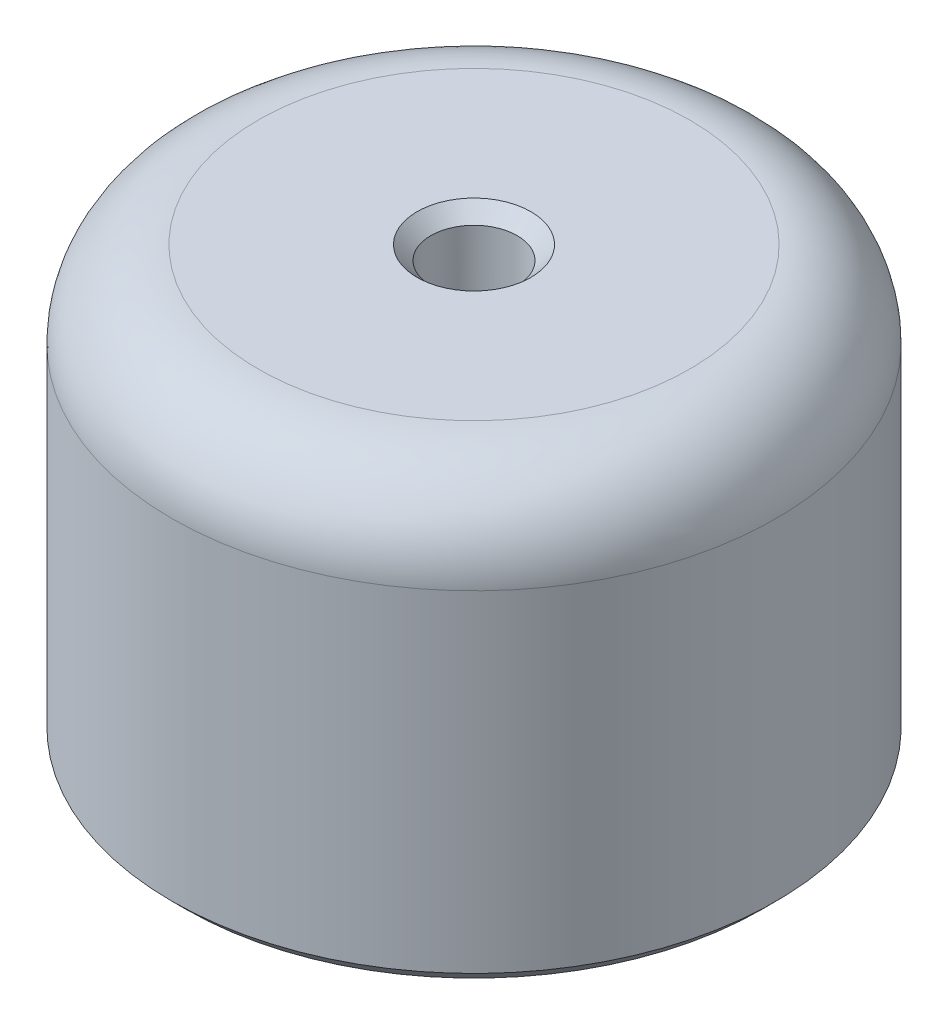
ISO-10303-21;
HEADER;
FILE_DESCRIPTION(('STEP AP214'),'2;1');
FILE_NAME('part.step','',(''),(''),'','','');
FILE_SCHEMA(('AUTOMOTIVE_DESIGN { 1 0 10303 214 1 1 1 1 }'));
ENDSEC;
DATA;
#1=APPLICATION_CONTEXT('core data for automotive mechanical design processes');
#2=APPLICATION_PROTOCOL_DEFINITION('international standard','automotive_design',2000,#1);
#3=PRODUCT_CONTEXT('',#1,'mechanical');
#4=PRODUCT('Part','Part','',(#3));
#5=PRODUCT_RELATED_PRODUCT_CATEGORY('part','',(#4));
#6=PRODUCT_DEFINITION_FORMATION('','',#4);
#7=PRODUCT_DEFINITION_CONTEXT('part definition',#1,'design');
#8=PRODUCT_DEFINITION('design','',#6,#7);
#9=PRODUCT_DEFINITION_SHAPE('','',#8);
#10=(LENGTH_UNIT() NAMED_UNIT(*) SI_UNIT(.MILLI.,.METRE.));
#11=(NAMED_UNIT(*) PLANE_ANGLE_UNIT() SI_UNIT($,.RADIAN.));
#12=(NAMED_UNIT(*) SI_UNIT($,.STERADIAN.) SOLID_ANGLE_UNIT());
#13=UNCERTAINTY_MEASURE_WITH_UNIT(LENGTH_MEASURE(1.E-05),#10,'distance_accuracy_value','');
#14=(GEOMETRIC_REPRESENTATION_CONTEXT(3) GLOBAL_UNCERTAINTY_ASSIGNED_CONTEXT((#13)) GLOBAL_UNIT_ASSIGNED_CONTEXT((#10,
#11,#12)) REPRESENTATION_CONTEXT('',''));
#15=CARTESIAN_POINT('',(0.,0.,0.));
#16=DIRECTION('',(0.,0.,1.));
#17=DIRECTION('',(1.,0.,0.));
#18=AXIS2_PLACEMENT_3D('',#15,#16,#17);
#19=CARTESIAN_POINT('',(11.1125,15.875,0.));
#20=DIRECTION('',(0.,-1.,0.));
#21=DIRECTION('',(0.,0.,-1.));
#22=AXIS2_PLACEMENT_3D('',#19,#20,#21);
#23=PLANE('',#22);
#24=CARTESIAN_POINT('',(0.,15.875,0.));
#25=DIRECTION('',(0.,-1.,0.));
#26=DIRECTION('',(0.,0.,-1.));
#27=AXIS2_PLACEMENT_3D('',#24,#25,#26);
#28=CIRCLE('',#27,2.09550000000001);
#29=CARTESIAN_POINT('',(0.,15.875,-2.09550000000001));
#30=VERTEX_POINT('',#29);
#31=EDGE_CURVE('E59',#30,#30,#28,.T.);
#32=ORIENTED_EDGE('',*,*,#31,.T.);
#33=EDGE_LOOP('',(#32));
#34=FACE_BOUND('',#33,.T.);
#35=CARTESIAN_POINT('',(0.,15.875,0.));
#36=DIRECTION('',(0.,-1.,0.));
#37=DIRECTION('',(0.,0.,-1.));
#38=AXIS2_PLACEMENT_3D('',#35,#36,#37);
#39=CIRCLE('',#38,7.9375);
#40=CARTESIAN_POINT('',(0.,15.875,-7.9375));
#41=VERTEX_POINT('',#40);
#42=EDGE_CURVE('E71',#41,#41,#39,.F.);
#43=ORIENTED_EDGE('',*,*,#42,.T.);
#44=EDGE_LOOP('',(#43));
#45=FACE_BOUND('',#44,.T.);
#46=ADVANCED_FACE('F30',(#34,#45),#23,.F.);
#47=CARTESIAN_POINT('',(0.,3.13706341911764,0.));
#48=DIRECTION('',(0.,1.,0.));
#49=DIRECTION('',(0.,0.,1.));
#50=AXIS2_PLACEMENT_3D('',#47,#48,#49);
#51=CYLINDRICAL_SURFACE('',#50,1.5875);
#52=CARTESIAN_POINT('',(0.,15.367,0.));
#53=DIRECTION('',(0.,-1.,0.));
#54=DIRECTION('',(0.,0.,-1.));
#55=AXIS2_PLACEMENT_3D('',#52,#53,#54);
#56=CIRCLE('',#55,1.5875);
#57=CARTESIAN_POINT('',(0.,15.367,-1.5875));
#58=VERTEX_POINT('',#57);
#59=EDGE_CURVE('E62',#58,#58,#56,.F.);
#60=ORIENTED_EDGE('',*,*,#59,.T.);
#61=EDGE_LOOP('',(#60));
#62=FACE_BOUND('',#61,.T.);
#63=CARTESIAN_POINT('',(0.,13.208,0.));
#64=DIRECTION('',(0.,1.,0.));
#65=DIRECTION('',(0.,0.,1.));
#66=AXIS2_PLACEMENT_3D('',#63,#64,#65);
#67=CIRCLE('',#66,1.5875);
#68=CARTESIAN_POINT('',(0.,13.208,1.5875));
#69=VERTEX_POINT('',#68);
#70=EDGE_CURVE('E65',#69,#69,#67,.F.);
#71=ORIENTED_EDGE('',*,*,#70,.T.);
#72=EDGE_LOOP('',(#71));
#73=FACE_BOUND('',#72,.T.);
#74=ADVANCED_FACE('F103',(#62,#73),#51,.F.);
#75=CARTESIAN_POINT('',(1.5875,12.7,0.));
#76=DIRECTION('',(0.,1.,0.));
#77=DIRECTION('',(0.,0.,1.));
#78=AXIS2_PLACEMENT_3D('',#75,#76,#77);
#79=PLANE('',#78);
#80=CARTESIAN_POINT('',(0.,12.7,0.));
#81=DIRECTION('',(0.,1.,0.));
#82=DIRECTION('',(0.,0.,1.));
#83=AXIS2_PLACEMENT_3D('',#80,#81,#82);
#84=CIRCLE('',#83,2.09549999999999);
#85=CARTESIAN_POINT('',(0.,12.7,2.09549999999999));
#86=VERTEX_POINT('',#85);
#87=EDGE_CURVE('E56',#86,#86,#84,.T.);
#88=ORIENTED_EDGE('',*,*,#87,.T.);
#89=EDGE_LOOP('',(#88));
#90=FACE_BOUND('',#89,.T.);
#91=CARTESIAN_POINT('',(0.,12.7,0.));
#92=DIRECTION('',(0.,1.,0.));
#93=DIRECTION('',(0.,0.,1.));
#94=AXIS2_PLACEMENT_3D('',#91,#92,#93);
#95=CIRCLE('',#94,4.7625);
#96=CARTESIAN_POINT('',(0.,12.7,4.7625));
#97=VERTEX_POINT('',#96);
#98=EDGE_CURVE('E74',#97,#97,#95,.F.);
#99=ORIENTED_EDGE('',*,*,#98,.T.);
#100=EDGE_LOOP('',(#99));
#101=FACE_BOUND('',#100,.T.);
#102=ADVANCED_FACE('F108',(#90,#101),#79,.F.);
#103=CARTESIAN_POINT('',(0.,3.13706341911764,0.));
#104=DIRECTION('',(0.,1.,0.));
#105=DIRECTION('',(0.,0.,1.));
#106=AXIS2_PLACEMENT_3D('',#103,#104,#105);
#107=CYLINDRICAL_SURFACE('',#106,6.35);
#108=CARTESIAN_POINT('',(0.,8.44550000000002,0.));
#109=DIRECTION('',(0.,1.,0.));
#110=DIRECTION('',(0.,0.,1.));
#111=AXIS2_PLACEMENT_3D('',#108,#109,#110);
#112=CIRCLE('',#111,6.35);
#113=CARTESIAN_POINT('',(0.,8.44550000000002,-6.35));
#114=VERTEX_POINT('',#113);
#115=EDGE_CURVE('E10',#114,#114,#112,.F.);
#116=ORIENTED_EDGE('',*,*,#115,.T.);
#117=EDGE_LOOP('',(#116));
#118=FACE_BOUND('',#117,.T.);
#119=CARTESIAN_POINT('',(0.,11.1125,0.));
#120=DIRECTION('',(0.,1.,0.));
#121=DIRECTION('',(0.,0.,1.));
#122=AXIS2_PLACEMENT_3D('',#119,#120,#121);
#123=CIRCLE('',#122,6.35);
#124=CARTESIAN_POINT('',(0.,11.1125,6.35));
#125=VERTEX_POINT('',#124);
#126=EDGE_CURVE('E77',#125,#125,#123,.T.);
#127=ORIENTED_EDGE('',*,*,#126,.T.);
#128=EDGE_LOOP('',(#127));
#129=FACE_BOUND('',#128,.T.);
#130=ADVANCED_FACE('F115',(#118,#129),#107,.F.);
#131=CARTESIAN_POINT('',(0.,3.13706341911764,0.));
#132=DIRECTION('',(0.,1.,0.));
#133=DIRECTION('',(0.,0.,1.));
#134=AXIS2_PLACEMENT_3D('',#131,#132,#133);
#135=CYLINDRICAL_SURFACE('',#134,7.9375);
#136=CARTESIAN_POINT('',(0.,0.508,0.));
#137=DIRECTION('',(0.,1.,0.));
#138=DIRECTION('',(0.,0.,1.));
#139=AXIS2_PLACEMENT_3D('',#136,#137,#138);
#140=CIRCLE('',#139,7.9375);
#141=CARTESIAN_POINT('',(0.,0.508,7.9375));
#142=VERTEX_POINT('',#141);
#143=EDGE_CURVE('E45',#142,#142,#140,.F.);
#144=ORIENTED_EDGE('',*,*,#143,.T.);
#145=EDGE_LOOP('',(#144));
#146=FACE_BOUND('',#145,.T.);
#147=CARTESIAN_POINT('',(0.,6.35,0.));
#148=DIRECTION('',(0.,1.,0.));
#149=DIRECTION('',(0.,0.,1.));
#150=AXIS2_PLACEMENT_3D('',#147,#148,#149);
#151=CIRCLE('',#150,7.9375);
#152=CARTESIAN_POINT('',(0.,6.35,7.9375));
#153=VERTEX_POINT('',#152);
#154=EDGE_CURVE('E80',#153,#153,#151,.T.);
#155=ORIENTED_EDGE('',*,*,#154,.T.);
#156=EDGE_LOOP('',(#155));
#157=FACE_BOUND('',#156,.T.);
#158=ADVANCED_FACE('F84',(#146,#157),#135,.F.);
#159=CARTESIAN_POINT('',(7.9375,0.,0.));
#160=DIRECTION('',(0.,1.,0.));
#161=DIRECTION('',(0.,0.,1.));
#162=AXIS2_PLACEMENT_3D('',#159,#160,#161);
#163=PLANE('',#162);
#164=CARTESIAN_POINT('',(0.,0.,0.));
#165=DIRECTION('',(0.,1.,0.));
#166=DIRECTION('',(0.,0.,1.));
#167=AXIS2_PLACEMENT_3D('',#164,#165,#166);
#168=CIRCLE('',#167,8.4455);
#169=CARTESIAN_POINT('',(0.,0.,8.4455));
#170=VERTEX_POINT('',#169);
#171=EDGE_CURVE('E50',#170,#170,#168,.T.);
#172=ORIENTED_EDGE('',*,*,#171,.T.);
#173=EDGE_LOOP('',(#172));
#174=FACE_BOUND('',#173,.T.);
#175=CARTESIAN_POINT('',(0.,0.,0.));
#176=DIRECTION('',(0.,1.,0.));
#177=DIRECTION('',(0.,0.,1.));
#178=AXIS2_PLACEMENT_3D('',#175,#176,#177);
#179=CIRCLE('',#178,10.6045);
#180=CARTESIAN_POINT('',(0.,0.,10.6045));
#181=VERTEX_POINT('',#180);
#182=EDGE_CURVE('E53',#181,#181,#179,.F.);
#183=ORIENTED_EDGE('',*,*,#182,.T.);
#184=EDGE_LOOP('',(#183));
#185=FACE_BOUND('',#184,.T.);
#186=ADVANCED_FACE('F98',(#174,#185),#163,.F.);
#187=CARTESIAN_POINT('',(0.,3.13706341911764,0.));
#188=DIRECTION('',(0.,1.,0.));
#189=DIRECTION('',(0.,0.,1.));
#190=AXIS2_PLACEMENT_3D('',#187,#188,#189);
#191=CYLINDRICAL_SURFACE('',#190,11.1125);
#192=CARTESIAN_POINT('',(0.,0.508000000000002,0.));
#193=DIRECTION('',(0.,1.,0.));
#194=DIRECTION('',(0.,0.,1.));
#195=AXIS2_PLACEMENT_3D('',#192,#193,#194);
#196=CIRCLE('',#195,11.1125);
#197=CARTESIAN_POINT('',(0.,0.508000000000002,11.1125));
#198=VERTEX_POINT('',#197);
#199=EDGE_CURVE('E41',#198,#198,#196,.T.);
#200=ORIENTED_EDGE('',*,*,#199,.T.);
#201=EDGE_LOOP('',(#200));
#202=FACE_BOUND('',#201,.T.);
#203=CARTESIAN_POINT('',(0.,12.7,0.));
#204=DIRECTION('',(0.,-1.,0.));
#205=DIRECTION('',(0.,0.,-1.));
#206=AXIS2_PLACEMENT_3D('',#203,#204,#205);
#207=CIRCLE('',#206,11.1125);
#208=CARTESIAN_POINT('',(0.,12.7,-11.1125));
#209=VERTEX_POINT('',#208);
#210=EDGE_CURVE('E68',#209,#209,#207,.T.);
#211=ORIENTED_EDGE('',*,*,#210,.T.);
#212=EDGE_LOOP('',(#211));
#213=FACE_BOUND('',#212,.T.);
#214=ADVANCED_FACE('F89',(#202,#213),#191,.T.);
#215=CARTESIAN_POINT('',(0.,6.35,0.));
#216=DIRECTION('',(0.,1.,0.));
#217=DIRECTION('',(0.,0.,1.));
#218=AXIS2_PLACEMENT_3D('',#215,#216,#217);
#219=TOROIDAL_SURFACE('',#218,6.35,1.5875);
#220=CARTESIAN_POINT('',(0.,7.80061233690925,0.));
#221=DIRECTION('',(0.,-1.,0.));
#222=DIRECTION('',(0.,0.,-1.));
#223=AXIS2_PLACEMENT_3D('',#220,#221,#222);
#224=CIRCLE('',#223,6.99488766309071);
#225=CARTESIAN_POINT('',(0.,7.80061233690925,-6.99488766309075));
#226=VERTEX_POINT('',#225);
#227=EDGE_CURVE('E37',#226,#226,#224,.F.);
#228=ORIENTED_EDGE('',*,*,#227,.T.);
#229=EDGE_LOOP('',(#228));
#230=FACE_BOUND('',#229,.T.);
#231=ORIENTED_EDGE('',*,*,#154,.F.);
#232=EDGE_LOOP('',(#231));
#233=FACE_BOUND('',#232,.T.);
#234=ADVANCED_FACE('F86',(#230,#233),#219,.F.);
#235=CARTESIAN_POINT('',(0.,11.1125,0.));
#236=DIRECTION('',(0.,1.,0.));
#237=DIRECTION('',(0.,0.,1.));
#238=AXIS2_PLACEMENT_3D('',#235,#236,#237);
#239=TOROIDAL_SURFACE('',#238,4.7625,1.5875);
#240=ORIENTED_EDGE('',*,*,#98,.F.);
#241=EDGE_LOOP('',(#240));
#242=FACE_BOUND('',#241,.T.);
#243=ORIENTED_EDGE('',*,*,#126,.F.);
#244=EDGE_LOOP('',(#243));
#245=FACE_BOUND('',#244,.T.);
#246=ADVANCED_FACE('F88',(#242,#245),#239,.F.);
#247=CARTESIAN_POINT('',(0.,12.7,0.));
#248=DIRECTION('',(0.,-1.,0.));
#249=DIRECTION('',(0.,0.,-1.));
#250=AXIS2_PLACEMENT_3D('',#247,#248,#249);
#251=TOROIDAL_SURFACE('',#250,7.9375,3.175);
#252=ORIENTED_EDGE('',*,*,#210,.F.);
#253=EDGE_LOOP('',(#252));
#254=FACE_BOUND('',#253,.T.);
#255=ORIENTED_EDGE('',*,*,#42,.F.);
#256=EDGE_LOOP('',(#255));
#257=FACE_BOUND('',#256,.T.);
#258=ADVANCED_FACE('F95',(#254,#257),#251,.T.);
#259=CARTESIAN_POINT('',(0.,15.367,0.));
#260=DIRECTION('',(0.,1.,0.));
#261=DIRECTION('',(0.,0.,1.));
#262=AXIS2_PLACEMENT_3D('',#259,#260,#261);
#263=CONICAL_SURFACE('',#262,1.5875,0.785398163397455);
#264=ORIENTED_EDGE('',*,*,#31,.F.);
#265=EDGE_LOOP('',(#264));
#266=FACE_BOUND('',#265,.T.);
#267=ORIENTED_EDGE('',*,*,#59,.F.);
#268=EDGE_LOOP('',(#267));
#269=FACE_BOUND('',#268,.T.);
#270=ADVANCED_FACE('F140',(#266,#269),#263,.F.);
#271=CARTESIAN_POINT('',(0.,12.7,0.));
#272=DIRECTION('',(0.,-1.,0.));
#273=DIRECTION('',(0.,0.,-1.));
#274=AXIS2_PLACEMENT_3D('',#271,#272,#273);
#275=CONICAL_SURFACE('',#274,2.09549999999999,0.785398163397442);
#276=ORIENTED_EDGE('',*,*,#70,.F.);
#277=EDGE_LOOP('',(#276));
#278=FACE_BOUND('',#277,.T.);
#279=ORIENTED_EDGE('',*,*,#87,.F.);
#280=EDGE_LOOP('',(#279));
#281=FACE_BOUND('',#280,.T.);
#282=ADVANCED_FACE('F146',(#278,#281),#275,.F.);
#283=CARTESIAN_POINT('',(0.,0.,0.));
#284=DIRECTION('',(0.,-1.,0.));
#285=DIRECTION('',(0.,0.,-1.));
#286=AXIS2_PLACEMENT_3D('',#283,#284,#285);
#287=CONICAL_SURFACE('',#286,8.4455,0.785398163397445);
#288=ORIENTED_EDGE('',*,*,#143,.F.);
#289=EDGE_LOOP('',(#288));
#290=FACE_BOUND('',#289,.T.);
#291=ORIENTED_EDGE('',*,*,#171,.F.);
#292=EDGE_LOOP('',(#291));
#293=FACE_BOUND('',#292,.T.);
#294=ADVANCED_FACE('F133',(#290,#293),#287,.F.);
#295=CARTESIAN_POINT('',(0.,0.508000000000002,0.));
#296=DIRECTION('',(0.,1.,0.));
#297=DIRECTION('',(0.,0.,1.));
#298=AXIS2_PLACEMENT_3D('',#295,#296,#297);
#299=CONICAL_SURFACE('',#298,11.1125,0.785398163397452);
#300=ORIENTED_EDGE('',*,*,#182,.F.);
#301=EDGE_LOOP('',(#300));
#302=FACE_BOUND('',#301,.T.);
#303=ORIENTED_EDGE('',*,*,#199,.F.);
#304=EDGE_LOOP('',(#303));
#305=FACE_BOUND('',#304,.T.);
#306=ADVANCED_FACE('F130',(#302,#305),#299,.T.);
#307=CARTESIAN_POINT('',(0.,7.80061233690927,0.));
#308=DIRECTION('',(0.,-1.,0.));
#309=DIRECTION('',(0.,0.,-1.));
#310=AXIS2_PLACEMENT_3D('',#307,#308,#309);
#311=CONICAL_SURFACE('',#310,6.99488766309072,0.785398163397433);
#312=CARTESIAN_POINT('',(0.,8.44550000000002,-6.35));
#313=CARTESIAN_POINT('',(0.,8.43878242017615,-6.35671757982386));
#314=CARTESIAN_POINT('',(0.,8.43206484035229,-6.36343515964772));
#315=CARTESIAN_POINT('',(0.,8.41862968070457,-6.37687031929545));
#316=CARTESIAN_POINT('',(0.,8.41191210088071,-6.38358789911931));
#317=CARTESIAN_POINT('',(0.,8.39847694123298,-6.39702305876703));
#318=CARTESIAN_POINT('',(0.,8.39175936140912,-6.4037406385909));
#319=CARTESIAN_POINT('',(0.,8.3783242017614,-6.41717579823862));
#320=CARTESIAN_POINT('',(0.,8.37160662193753,-6.42389337806248));
#321=CARTESIAN_POINT('',(0.,8.35817146228981,-6.43732853771021));
#322=CARTESIAN_POINT('',(0.,8.35145388246595,-6.44404611753407));
#323=CARTESIAN_POINT('',(0.,8.33801872281822,-6.45748127718179));
#324=CARTESIAN_POINT('',(0.,8.33130114299436,-6.46419885700565));
#325=CARTESIAN_POINT('',(0.,8.31786598334664,-6.47763401665338));
#326=CARTESIAN_POINT('',(0.,8.31114840352277,-6.48435159647724));
#327=CARTESIAN_POINT('',(0.,8.29771324387505,-6.49778675612496));
#328=CARTESIAN_POINT('',(0.,8.29099566405119,-6.50450433594883));
#329=CARTESIAN_POINT('',(0.,8.27756050440346,-6.51793949559655));
#330=CARTESIAN_POINT('',(0.,8.2708429245796,-6.52465707542041));
#331=CARTESIAN_POINT('',(0.,8.25740776493188,-6.53809223506813));
#332=CARTESIAN_POINT('',(0.,8.25069018510801,-6.544809814892));
#333=CARTESIAN_POINT('',(0.,8.23725502546029,-6.55824497453972));
#334=CARTESIAN_POINT('',(0.,8.23053744563643,-6.56496255436358));
#335=CARTESIAN_POINT('',(0.,8.2171022859887,-6.57839771401131));
#336=CARTESIAN_POINT('',(0.,8.21038470616484,-6.58511529383517));
#337=CARTESIAN_POINT('',(0.,8.19694954651712,-6.59855045348289));
#338=CARTESIAN_POINT('',(0.,8.19023196669325,-6.60526803330675));
#339=CARTESIAN_POINT('',(0.,8.17679680704553,-6.61870319295448));
#340=CARTESIAN_POINT('',(0.,8.17007922722167,-6.62542077277834));
#341=CARTESIAN_POINT('',(0.,8.15664406757394,-6.63885593242606));
#342=CARTESIAN_POINT('',(0.,8.14992648775008,-6.64557351224993));
#343=CARTESIAN_POINT('',(0.,8.13649132810236,-6.65900867189765));
#344=CARTESIAN_POINT('',(0.,8.1297737482785,-6.66572625172151));
#345=CARTESIAN_POINT('',(0.,8.11633858863077,-6.67916141136924));
#346=CARTESIAN_POINT('',(0.,8.10962100880691,-6.6858789911931));
#347=CARTESIAN_POINT('',(0.,8.09618584915918,-6.69931415084082));
#348=CARTESIAN_POINT('',(0.,8.08946826933532,-6.70603173066468));
#349=CARTESIAN_POINT('',(0.,8.0760331096876,-6.71946689031241));
#350=CARTESIAN_POINT('',(0.,8.06931552986374,-6.72618447013627));
#351=CARTESIAN_POINT('',(0.,8.05588037021601,-6.73961962978399));
#352=CARTESIAN_POINT('',(0.,8.04916279039215,-6.74633720960786));
#353=CARTESIAN_POINT('',(0.,8.03572763074443,-6.75977236925558));
#354=CARTESIAN_POINT('',(0.,8.02901005092056,-6.76648994907944));
#355=CARTESIAN_POINT('',(0.,8.01557489127284,-6.77992510872716));
#356=CARTESIAN_POINT('',(0.,8.00885731144898,-6.78664268855103));
#357=CARTESIAN_POINT('',(0.,7.99542215180125,-6.80007784819875));
#358=CARTESIAN_POINT('',(0.,7.98870457197739,-6.80679542802261));
#359=CARTESIAN_POINT('',(0.,7.97526941232967,-6.82023058767034));
#360=CARTESIAN_POINT('',(0.,7.9685518325058,-6.8269481674942));
#361=CARTESIAN_POINT('',(0.,7.95511667285808,-6.84038332714192));
#362=CARTESIAN_POINT('',(0.,7.94839909303422,-6.84710090696579));
#363=CARTESIAN_POINT('',(0.,7.93496393338649,-6.86053606661351));
#364=CARTESIAN_POINT('',(0.,7.92824635356263,-6.86725364643737));
#365=CARTESIAN_POINT('',(0.,7.91481119391491,-6.88068880608509));
#366=CARTESIAN_POINT('',(0.,7.90809361409104,-6.88740638590896));
#367=CARTESIAN_POINT('',(0.,7.89465845444332,-6.90084154555668));
#368=CARTESIAN_POINT('',(0.,7.88794087461946,-6.90755912538054));
#369=CARTESIAN_POINT('',(0.,7.87450571497173,-6.92099428502827));
#370=CARTESIAN_POINT('',(0.,7.86778813514787,-6.92771186485213));
#371=CARTESIAN_POINT('',(0.,7.85435297550015,-6.94114702449985));
#372=CARTESIAN_POINT('',(0.,7.84763539567628,-6.94786460432371));
#373=CARTESIAN_POINT('',(0.,7.83420023602856,-6.96129976397144));
#374=CARTESIAN_POINT('',(0.,7.8274826562047,-6.9680173437953));
#375=CARTESIAN_POINT('',(0.,7.81404749655697,-6.98145250344302));
#376=CARTESIAN_POINT('',(0.,7.80732991673311,-6.98817008326689));
#377=CARTESIAN_POINT('',(0.,7.80061233690925,-6.99488766309075));
#378=B_SPLINE_CURVE_WITH_KNOTS('',3,(#312,#313,#314,#315,#316,#317,#318,#319,#320,#321,#322,
#323,#324,#325,#326,#327,#328,#329,#330,#331,#332,#333,#334,#335,#336,#337,#338,#339,#340,#341,
#342,#343,#344,#345,#346,#347,#348,#349,#350,#351,#352,#353,#354,#355,#356,#357,#358,#359,#360,
#361,#362,#363,#364,#365,#366,#367,#368,#369,#370,#371,#372,#373,#374,#375,#376,#377),
.UNSPECIFIED.,.F.,.F.,(4,2,2,2,2,2,2,2,2,2,2,2,2,2,2,2,2,2,2,2,2,2,2,2,2,2,2,2,2,2,2,2,4),(0.,
0.0285002774796889,0.0570005549593783,0.085500832439066,0.114001109918755,0.142501387398445,
0.171001664878133,0.199501942357822,0.22800221983751,0.256502497317199,0.285002774796888,
0.313503052276576,0.342003329756265,0.370503607235955,0.399003884715642,0.427504162195332,
0.456004439675021,0.484504717154709,0.513004994634398,0.541505272114086,0.570005549593775,
0.598505827073464,0.627006104553153,0.655506382032842,0.684006659512531,0.712506936992219,
0.741007214471908,0.769507491951597,0.798007769431285,0.826508046910975,0.855008324390663,
0.883508601870352,0.91200887935004),.UNSPECIFIED.);
#379=EDGE_CURVE('BSEAM32',#114,#226,#378,.T.);
#380=ORIENTED_EDGE('',*,*,#115,.F.);
#381=ORIENTED_EDGE('',*,*,#227,.F.);
#382=ORIENTED_EDGE('',*,*,#379,.T.);
#383=ORIENTED_EDGE('',*,*,#379,.F.);
#384=EDGE_LOOP('',(#380,#382,#381,#383));
#385=FACE_BOUND('',#384,.T.);
#386=ADVANCED_FACE('F32',(#385),#311,.F.);
#387=CLOSED_SHELL('',(#46,#74,#102,#130,#158,#186,#214,#234,#246,#258,#270,#282,#294,#306,#386));
#388=MANIFOLD_SOLID_BREP('B2',#387);
#389=ADVANCED_BREP_SHAPE_REPRESENTATION('',(#18,#388),#14);
#390=SHAPE_DEFINITION_REPRESENTATION(#9,#389);
ENDSEC;
END-ISO-10303-21;
